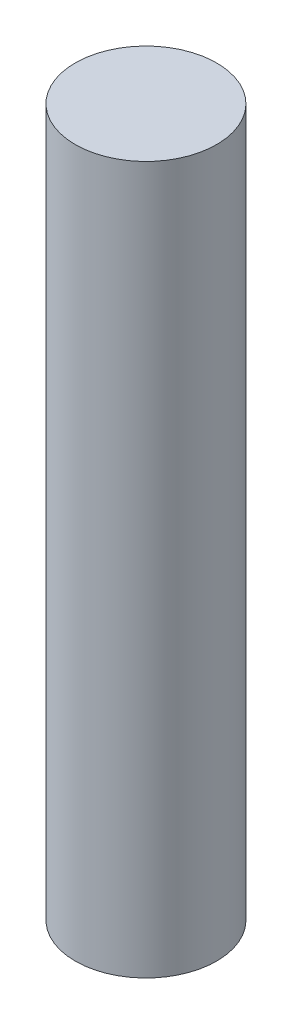
ISO-10303-21;
HEADER;
FILE_DESCRIPTION(('STEP AP214'),'2;1');
FILE_NAME('part.step','',(''),(''),'','','');
FILE_SCHEMA(('AUTOMOTIVE_DESIGN { 1 0 10303 214 1 1 1 1 }'));
ENDSEC;
DATA;
#1=APPLICATION_CONTEXT('core data for automotive mechanical design processes');
#2=APPLICATION_PROTOCOL_DEFINITION('international standard','automotive_design',2000,#1);
#3=PRODUCT_CONTEXT('',#1,'mechanical');
#4=PRODUCT('Part','Part','',(#3));
#5=PRODUCT_RELATED_PRODUCT_CATEGORY('part','',(#4));
#6=PRODUCT_DEFINITION_FORMATION('','',#4);
#7=PRODUCT_DEFINITION_CONTEXT('part definition',#1,'design');
#8=PRODUCT_DEFINITION('design','',#6,#7);
#9=PRODUCT_DEFINITION_SHAPE('','',#8);
#10=(LENGTH_UNIT() NAMED_UNIT(*) SI_UNIT(.MILLI.,.METRE.));
#11=(NAMED_UNIT(*) PLANE_ANGLE_UNIT() SI_UNIT($,.RADIAN.));
#12=(NAMED_UNIT(*) SI_UNIT($,.STERADIAN.) SOLID_ANGLE_UNIT());
#13=UNCERTAINTY_MEASURE_WITH_UNIT(LENGTH_MEASURE(1.E-05),#10,'distance_accuracy_value','');
#14=(GEOMETRIC_REPRESENTATION_CONTEXT(3) GLOBAL_UNCERTAINTY_ASSIGNED_CONTEXT((#13)) GLOBAL_UNIT_ASSIGNED_CONTEXT((#10,
#11,#12)) REPRESENTATION_CONTEXT('',''));
#15=CARTESIAN_POINT('',(0.,0.,0.));
#16=DIRECTION('',(0.,0.,1.));
#17=DIRECTION('',(1.,0.,0.));
#18=AXIS2_PLACEMENT_3D('',#15,#16,#17);
#19=CARTESIAN_POINT('',(0.,32.,0.));
#20=DIRECTION('',(0.,-1.,0.));
#21=DIRECTION('',(0.,0.,-1.));
#22=AXIS2_PLACEMENT_3D('',#19,#20,#21);
#23=CYLINDRICAL_SURFACE('',#22,3.2);
#24=CARTESIAN_POINT('',(0.,32.,0.));
#25=DIRECTION('',(0.,1.,0.));
#26=DIRECTION('',(0.,0.,1.));
#27=AXIS2_PLACEMENT_3D('',#24,#25,#26);
#28=CIRCLE('',#27,3.2);
#29=CARTESIAN_POINT('',(0.,32.,3.2));
#30=VERTEX_POINT('',#29);
#31=EDGE_CURVE('E10',#30,#30,#28,.T.);
#32=ORIENTED_EDGE('',*,*,#31,.F.);
#33=EDGE_LOOP('',(#32));
#34=FACE_BOUND('',#33,.T.);
#35=CARTESIAN_POINT('',(0.,0.,0.));
#36=DIRECTION('',(0.,1.,0.));
#37=DIRECTION('',(0.,0.,1.));
#38=AXIS2_PLACEMENT_3D('',#35,#36,#37);
#39=CIRCLE('',#38,3.2);
#40=CARTESIAN_POINT('',(0.,0.,3.2));
#41=VERTEX_POINT('',#40);
#42=EDGE_CURVE('E40',#41,#41,#39,.T.);
#43=ORIENTED_EDGE('',*,*,#42,.T.);
#44=EDGE_LOOP('',(#43));
#45=FACE_BOUND('',#44,.T.);
#46=ADVANCED_FACE('F37',(#34,#45),#23,.T.);
#47=CARTESIAN_POINT('',(0.,32.,0.));
#48=DIRECTION('',(0.,1.,0.));
#49=DIRECTION('',(0.,0.,1.));
#50=AXIS2_PLACEMENT_3D('',#47,#48,#49);
#51=PLANE('',#50);
#52=ORIENTED_EDGE('',*,*,#31,.T.);
#53=EDGE_LOOP('',(#52));
#54=FACE_BOUND('',#53,.T.);
#55=ADVANCED_FACE('F54',(#54),#51,.T.);
#56=CARTESIAN_POINT('',(0.,0.,0.));
#57=DIRECTION('',(0.,1.,0.));
#58=DIRECTION('',(0.,0.,1.));
#59=AXIS2_PLACEMENT_3D('',#56,#57,#58);
#60=PLANE('',#59);
#61=ORIENTED_EDGE('',*,*,#42,.F.);
#62=EDGE_LOOP('',(#61));
#63=FACE_BOUND('',#62,.T.);
#64=ADVANCED_FACE('F52',(#63),#60,.F.);
#65=CLOSED_SHELL('',(#46,#55,#64));
#66=MANIFOLD_SOLID_BREP('B2',#65);
#67=ADVANCED_BREP_SHAPE_REPRESENTATION('',(#18,#66),#14);
#68=SHAPE_DEFINITION_REPRESENTATION(#9,#67);
ENDSEC;
END-ISO-10303-21;
